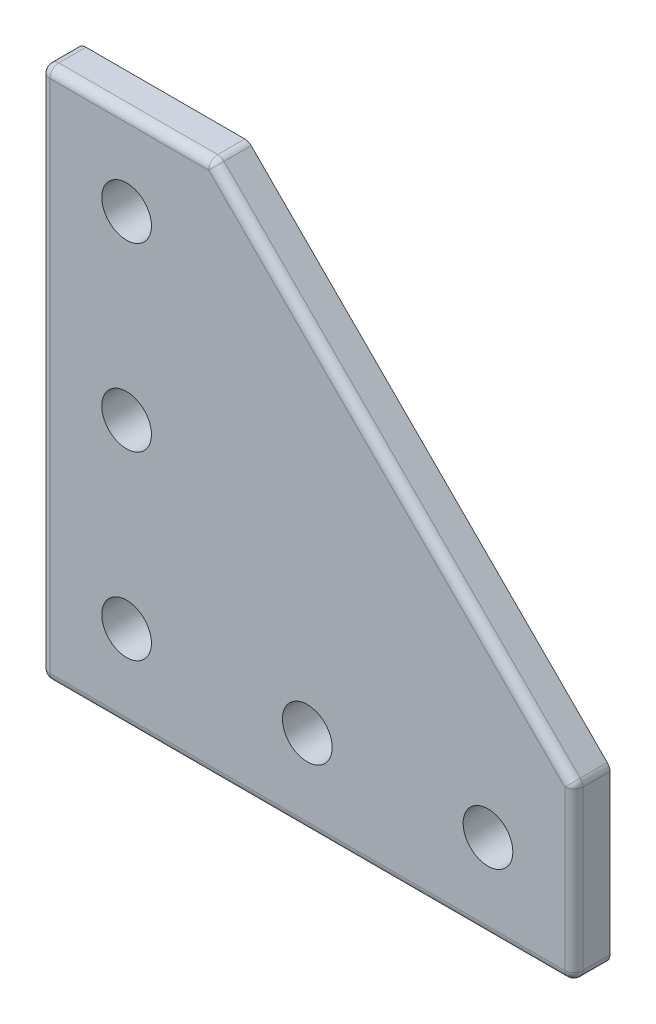
ISO-10303-21;
HEADER;
FILE_DESCRIPTION(('STEP AP214'),'2;1');
FILE_NAME('part.step','',(''),(''),'','','');
FILE_SCHEMA(('AUTOMOTIVE_DESIGN { 1 0 10303 214 1 1 1 1 }'));
ENDSEC;
DATA;
#1=APPLICATION_CONTEXT('core data for automotive mechanical design processes');
#2=APPLICATION_PROTOCOL_DEFINITION('international standard','automotive_design',2000,#1);
#3=PRODUCT_CONTEXT('',#1,'mechanical');
#4=PRODUCT('Part','Part','',(#3));
#5=PRODUCT_RELATED_PRODUCT_CATEGORY('part','',(#4));
#6=PRODUCT_DEFINITION_FORMATION('','',#4);
#7=PRODUCT_DEFINITION_CONTEXT('part definition',#1,'design');
#8=PRODUCT_DEFINITION('design','',#6,#7);
#9=PRODUCT_DEFINITION_SHAPE('','',#8);
#10=(LENGTH_UNIT() NAMED_UNIT(*) SI_UNIT(.MILLI.,.METRE.));
#11=(NAMED_UNIT(*) PLANE_ANGLE_UNIT() SI_UNIT($,.RADIAN.));
#12=(NAMED_UNIT(*) SI_UNIT($,.STERADIAN.) SOLID_ANGLE_UNIT());
#13=UNCERTAINTY_MEASURE_WITH_UNIT(LENGTH_MEASURE(1.E-05),#10,'distance_accuracy_value','');
#14=(GEOMETRIC_REPRESENTATION_CONTEXT(3) GLOBAL_UNCERTAINTY_ASSIGNED_CONTEXT((#13)) GLOBAL_UNIT_ASSIGNED_CONTEXT((#10,
#11,#12)) REPRESENTATION_CONTEXT('',''));
#15=CARTESIAN_POINT('',(0.,0.,0.));
#16=DIRECTION('',(0.,0.,1.));
#17=DIRECTION('',(1.,0.,0.));
#18=AXIS2_PLACEMENT_3D('',#15,#16,#17);
#19=CARTESIAN_POINT('',(0.,0.,2.));
#20=DIRECTION('',(0.,0.,-1.));
#21=DIRECTION('',(-1.,0.,0.));
#22=AXIS2_PLACEMENT_3D('',#19,#20,#21);
#23=PLANE('',#22);
#24=DIRECTION('',(0.,-1.,0.));
#25=VECTOR('',#24,1.);
#26=CARTESIAN_POINT('',(1.,0.,2.));
#27=LINE('',#26,#25);
#28=CARTESIAN_POINT('',(1.,58.,2.));
#29=VERTEX_POINT('',#28);
#30=CARTESIAN_POINT('',(1.,1.,2.));
#31=VERTEX_POINT('',#30);
#32=EDGE_CURVE('E1163',#29,#31,#27,.T.);
#33=ORIENTED_EDGE('',*,*,#32,.T.);
#34=DIRECTION('',(1.,0.,0.));
#35=VECTOR('',#34,1.);
#36=CARTESIAN_POINT('',(0.,1.,2.));
#37=LINE('',#36,#35);
#38=CARTESIAN_POINT('',(58.,0.999999999999998,2.));
#39=VERTEX_POINT('',#38);
#40=EDGE_CURVE('E1170',#31,#39,#37,.T.);
#41=ORIENTED_EDGE('',*,*,#40,.T.);
#42=DIRECTION('',(0.,1.,0.));
#43=VECTOR('',#42,1.);
#44=CARTESIAN_POINT('',(58.,0.,2.));
#45=LINE('',#44,#43);
#46=CARTESIAN_POINT('',(58.,18.5857864376269,2.));
#47=VERTEX_POINT('',#46);
#48=EDGE_CURVE('E1168',#39,#47,#45,.T.);
#49=ORIENTED_EDGE('',*,*,#48,.T.);
#50=DIRECTION('',(-0.707106781186547,0.707106781186548,0.));
#51=VECTOR('',#50,1.);
#52=CARTESIAN_POINT('',(38.2928932188135,38.2928932188134,2.));
#53=LINE('',#52,#51);
#54=CARTESIAN_POINT('',(18.5857864376269,58.,2.));
#55=VERTEX_POINT('',#54);
#56=EDGE_CURVE('E1165',#47,#55,#53,.T.);
#57=ORIENTED_EDGE('',*,*,#56,.T.);
#58=DIRECTION('',(-1.,0.,0.));
#59=VECTOR('',#58,1.);
#60=CARTESIAN_POINT('',(0.,58.,2.));
#61=LINE('',#60,#59);
#62=EDGE_CURVE('E1161',#55,#29,#61,.T.);
#63=ORIENTED_EDGE('',*,*,#62,.T.);
#64=EDGE_LOOP('',(#33,#41,#49,#57,#63));
#65=FACE_BOUND('',#64,.T.);
#66=CARTESIAN_POINT('',(9.5,29.5,2.));
#67=DIRECTION('',(0.,0.,1.));
#68=DIRECTION('',(1.,0.,0.));
#69=AXIS2_PLACEMENT_3D('',#66,#67,#68);
#70=CIRCLE('',#69,2.75000000000001);
#71=CARTESIAN_POINT('',(12.25,29.5,2.));
#72=VERTEX_POINT('',#71);
#73=EDGE_CURVE('E1240',#72,#72,#70,.T.);
#74=ORIENTED_EDGE('',*,*,#73,.F.);
#75=EDGE_LOOP('',(#74));
#76=FACE_BOUND('',#75,.T.);
#77=CARTESIAN_POINT('',(29.5,9.49999999999999,2.));
#78=DIRECTION('',(0.,0.,1.));
#79=DIRECTION('',(1.,0.,0.));
#80=AXIS2_PLACEMENT_3D('',#77,#78,#79);
#81=CIRCLE('',#80,2.75);
#82=CARTESIAN_POINT('',(32.25,9.49999999999999,2.));
#83=VERTEX_POINT('',#82);
#84=EDGE_CURVE('E1252',#83,#83,#81,.T.);
#85=ORIENTED_EDGE('',*,*,#84,.F.);
#86=EDGE_LOOP('',(#85));
#87=FACE_BOUND('',#86,.T.);
#88=CARTESIAN_POINT('',(9.5,9.49999999999999,2.));
#89=DIRECTION('',(0.,0.,1.));
#90=DIRECTION('',(1.,0.,0.));
#91=AXIS2_PLACEMENT_3D('',#88,#89,#90);
#92=CIRCLE('',#91,2.75);
#93=CARTESIAN_POINT('',(12.25,9.49999999999999,2.));
#94=VERTEX_POINT('',#93);
#95=EDGE_CURVE('E1258',#94,#94,#92,.T.);
#96=ORIENTED_EDGE('',*,*,#95,.F.);
#97=EDGE_LOOP('',(#96));
#98=FACE_BOUND('',#97,.T.);
#99=CARTESIAN_POINT('',(49.5,9.49999999999999,2.));
#100=DIRECTION('',(0.,0.,1.));
#101=DIRECTION('',(1.,0.,0.));
#102=AXIS2_PLACEMENT_3D('',#99,#100,#101);
#103=CIRCLE('',#102,2.75000000000001);
#104=CARTESIAN_POINT('',(52.25,9.49999999999999,2.));
#105=VERTEX_POINT('',#104);
#106=EDGE_CURVE('E1246',#105,#105,#103,.T.);
#107=ORIENTED_EDGE('',*,*,#106,.F.);
#108=EDGE_LOOP('',(#107));
#109=FACE_BOUND('',#108,.T.);
#110=CARTESIAN_POINT('',(9.5,49.5,2.));
#111=DIRECTION('',(0.,0.,1.));
#112=DIRECTION('',(1.,0.,0.));
#113=AXIS2_PLACEMENT_3D('',#110,#111,#112);
#114=CIRCLE('',#113,2.75);
#115=CARTESIAN_POINT('',(12.25,49.5,2.));
#116=VERTEX_POINT('',#115);
#117=EDGE_CURVE('E1232',#116,#116,#114,.T.);
#118=ORIENTED_EDGE('',*,*,#117,.F.);
#119=EDGE_LOOP('',(#118));
#120=FACE_BOUND('',#119,.T.);
#121=ADVANCED_FACE('F1020',(#65,#76,#87,#98,#109,#120),#23,.F.);
#122=CARTESIAN_POINT('',(0.,0.,-2.));
#123=DIRECTION('',(0.,0.,-1.));
#124=DIRECTION('',(-1.,0.,0.));
#125=AXIS2_PLACEMENT_3D('',#122,#123,#124);
#126=PLANE('',#125);
#127=CARTESIAN_POINT('',(9.5,29.5,-2.));
#128=DIRECTION('',(0.,0.,1.));
#129=DIRECTION('',(1.,0.,0.));
#130=AXIS2_PLACEMENT_3D('',#127,#128,#129);
#131=CIRCLE('',#130,2.75000000000001);
#132=CARTESIAN_POINT('',(12.25,29.5,-2.));
#133=VERTEX_POINT('',#132);
#134=EDGE_CURVE('E1237',#133,#133,#131,.T.);
#135=ORIENTED_EDGE('',*,*,#134,.T.);
#136=EDGE_LOOP('',(#135));
#137=FACE_BOUND('',#136,.T.);
#138=CARTESIAN_POINT('',(29.5,9.49999999999999,-2.));
#139=DIRECTION('',(0.,0.,1.));
#140=DIRECTION('',(1.,0.,0.));
#141=AXIS2_PLACEMENT_3D('',#138,#139,#140);
#142=CIRCLE('',#141,2.75);
#143=CARTESIAN_POINT('',(32.25,9.49999999999999,-2.));
#144=VERTEX_POINT('',#143);
#145=EDGE_CURVE('E1249',#144,#144,#142,.T.);
#146=ORIENTED_EDGE('',*,*,#145,.T.);
#147=EDGE_LOOP('',(#146));
#148=FACE_BOUND('',#147,.T.);
#149=DIRECTION('',(-0.707106781186547,0.707106781186548,0.));
#150=VECTOR('',#149,1.);
#151=CARTESIAN_POINT('',(19.,59.,-2.));
#152=LINE('',#151,#150);
#153=CARTESIAN_POINT('',(58.7071067811865,19.2928932188134,-2.));
#154=VERTEX_POINT('',#153);
#155=CARTESIAN_POINT('',(19.2928932188135,58.7071067811865,-2.));
#156=VERTEX_POINT('',#155);
#157=EDGE_CURVE('E1126',#154,#156,#152,.T.);
#158=ORIENTED_EDGE('',*,*,#157,.F.);
#159=CARTESIAN_POINT('',(58.,18.5857864376269,-2.));
#160=DIRECTION('',(0.,0.,-1.));
#161=DIRECTION('',(-1.,0.,0.));
#162=AXIS2_PLACEMENT_3D('',#159,#160,#161);
#163=CIRCLE('',#162,1.);
#164=CARTESIAN_POINT('',(59.,18.5857864376269,-2.));
#165=VERTEX_POINT('',#164);
#166=EDGE_CURVE('E1110',#154,#165,#163,.T.);
#167=ORIENTED_EDGE('',*,*,#166,.T.);
#168=DIRECTION('',(0.,1.,0.));
#169=VECTOR('',#168,1.);
#170=CARTESIAN_POINT('',(59.,19.,-2.));
#171=LINE('',#170,#169);
#172=CARTESIAN_POINT('',(59.,0.999999999999997,-2.));
#173=VERTEX_POINT('',#172);
#174=EDGE_CURVE('E1138',#173,#165,#171,.T.);
#175=ORIENTED_EDGE('',*,*,#174,.F.);
#176=CARTESIAN_POINT('',(58.,0.999999999999997,-2.));
#177=DIRECTION('',(0.,0.,-1.));
#178=DIRECTION('',(-1.,0.,0.));
#179=AXIS2_PLACEMENT_3D('',#176,#177,#178);
#180=CIRCLE('',#179,1.);
#181=CARTESIAN_POINT('',(58.,0.,-2.));
#182=VERTEX_POINT('',#181);
#183=EDGE_CURVE('E1152',#173,#182,#180,.T.);
#184=ORIENTED_EDGE('',*,*,#183,.T.);
#185=DIRECTION('',(1.,0.,0.));
#186=VECTOR('',#185,1.);
#187=CARTESIAN_POINT('',(59.,0.,-2.));
#188=LINE('',#187,#186);
#189=CARTESIAN_POINT('',(1.,0.,-2.));
#190=VERTEX_POINT('',#189);
#191=EDGE_CURVE('E1143',#190,#182,#188,.T.);
#192=ORIENTED_EDGE('',*,*,#191,.F.);
#193=CARTESIAN_POINT('',(1.,1.,-2.));
#194=DIRECTION('',(0.,0.,-1.));
#195=DIRECTION('',(-1.,0.,0.));
#196=AXIS2_PLACEMENT_3D('',#193,#194,#195);
#197=CIRCLE('',#196,1.);
#198=CARTESIAN_POINT('',(0.,1.,-2.));
#199=VERTEX_POINT('',#198);
#200=EDGE_CURVE('E1154',#190,#199,#197,.T.);
#201=ORIENTED_EDGE('',*,*,#200,.T.);
#202=DIRECTION('',(0.,-1.,0.));
#203=VECTOR('',#202,1.);
#204=CARTESIAN_POINT('',(0.,0.,-2.));
#205=LINE('',#204,#203);
#206=CARTESIAN_POINT('',(0.,58.,-2.));
#207=VERTEX_POINT('',#206);
#208=EDGE_CURVE('E1141',#207,#199,#205,.T.);
#209=ORIENTED_EDGE('',*,*,#208,.F.);
#210=CARTESIAN_POINT('',(1.,58.,-2.));
#211=DIRECTION('',(0.,0.,-1.));
#212=DIRECTION('',(-1.,0.,0.));
#213=AXIS2_PLACEMENT_3D('',#210,#211,#212);
#214=CIRCLE('',#213,1.);
#215=CARTESIAN_POINT('',(1.,59.,-2.));
#216=VERTEX_POINT('',#215);
#217=EDGE_CURVE('E1131',#207,#216,#214,.T.);
#218=ORIENTED_EDGE('',*,*,#217,.T.);
#219=DIRECTION('',(-1.,0.,0.));
#220=VECTOR('',#219,1.);
#221=CARTESIAN_POINT('',(19.,59.,-2.));
#222=LINE('',#221,#220);
#223=CARTESIAN_POINT('',(18.5857864376269,59.,-2.));
#224=VERTEX_POINT('',#223);
#225=EDGE_CURVE('E1137',#224,#216,#222,.T.);
#226=ORIENTED_EDGE('',*,*,#225,.F.);
#227=CARTESIAN_POINT('',(18.5857864376269,58.,-2.));
#228=DIRECTION('',(0.,0.,-1.));
#229=DIRECTION('',(-1.,0.,0.));
#230=AXIS2_PLACEMENT_3D('',#227,#228,#229);
#231=CIRCLE('',#230,1.);
#232=EDGE_CURVE('E1121',#224,#156,#231,.T.);
#233=ORIENTED_EDGE('',*,*,#232,.T.);
#234=EDGE_LOOP('',(#158,#167,#175,#184,#192,#201,#209,#218,#226,#233));
#235=FACE_BOUND('',#234,.T.);
#236=CARTESIAN_POINT('',(9.5,9.49999999999999,-2.));
#237=DIRECTION('',(0.,0.,1.));
#238=DIRECTION('',(1.,0.,0.));
#239=AXIS2_PLACEMENT_3D('',#236,#237,#238);
#240=CIRCLE('',#239,2.75);
#241=CARTESIAN_POINT('',(12.25,9.49999999999999,-2.));
#242=VERTEX_POINT('',#241);
#243=EDGE_CURVE('E1255',#242,#242,#240,.T.);
#244=ORIENTED_EDGE('',*,*,#243,.T.);
#245=EDGE_LOOP('',(#244));
#246=FACE_BOUND('',#245,.T.);
#247=CARTESIAN_POINT('',(49.5,9.49999999999999,-2.));
#248=DIRECTION('',(0.,0.,1.));
#249=DIRECTION('',(1.,0.,0.));
#250=AXIS2_PLACEMENT_3D('',#247,#248,#249);
#251=CIRCLE('',#250,2.75000000000001);
#252=CARTESIAN_POINT('',(52.25,9.49999999999999,-2.));
#253=VERTEX_POINT('',#252);
#254=EDGE_CURVE('E1243',#253,#253,#251,.T.);
#255=ORIENTED_EDGE('',*,*,#254,.T.);
#256=EDGE_LOOP('',(#255));
#257=FACE_BOUND('',#256,.T.);
#258=CARTESIAN_POINT('',(9.5,49.5,-2.));
#259=DIRECTION('',(0.,0.,1.));
#260=DIRECTION('',(1.,0.,0.));
#261=AXIS2_PLACEMENT_3D('',#258,#259,#260);
#262=CIRCLE('',#261,2.75);
#263=CARTESIAN_POINT('',(12.25,49.5,-2.));
#264=VERTEX_POINT('',#263);
#265=EDGE_CURVE('E1229',#264,#264,#262,.T.);
#266=ORIENTED_EDGE('',*,*,#265,.T.);
#267=EDGE_LOOP('',(#266));
#268=FACE_BOUND('',#267,.T.);
#269=ADVANCED_FACE('F1133',(#137,#148,#235,#246,#257,#268),#126,.T.);
#270=CARTESIAN_POINT('',(59.,0.,2.));
#271=DIRECTION('',(0.,1.,0.));
#272=DIRECTION('',(-1.,0.,0.));
#273=AXIS2_PLACEMENT_3D('',#270,#271,#272);
#274=PLANE('',#273);
#275=DIRECTION('',(1.,0.,0.));
#276=VECTOR('',#275,1.);
#277=CARTESIAN_POINT('',(59.,0.,1.));
#278=LINE('',#277,#276);
#279=CARTESIAN_POINT('',(58.,0.,1.));
#280=VERTEX_POINT('',#279);
#281=CARTESIAN_POINT('',(1.,0.,1.));
#282=VERTEX_POINT('',#281);
#283=EDGE_CURVE('E1180',#280,#282,#278,.F.);
#284=ORIENTED_EDGE('',*,*,#283,.T.);
#285=DIRECTION('',(0.,0.,-1.));
#286=VECTOR('',#285,1.);
#287=CARTESIAN_POINT('',(1.,0.,2.));
#288=LINE('',#287,#286);
#289=EDGE_CURVE('E1182',#282,#190,#288,.T.);
#290=ORIENTED_EDGE('',*,*,#289,.T.);
#291=ORIENTED_EDGE('',*,*,#191,.T.);
#292=DIRECTION('',(0.,0.,-1.));
#293=VECTOR('',#292,1.);
#294=CARTESIAN_POINT('',(58.,0.,2.));
#295=LINE('',#294,#293);
#296=EDGE_CURVE('E1178',#182,#280,#295,.F.);
#297=ORIENTED_EDGE('',*,*,#296,.T.);
#298=EDGE_LOOP('',(#284,#290,#291,#297));
#299=FACE_BOUND('',#298,.T.);
#300=ADVANCED_FACE('F1266',(#299),#274,.F.);
#301=CARTESIAN_POINT('',(59.,19.,2.));
#302=DIRECTION('',(-1.,0.,0.));
#303=DIRECTION('',(0.,0.,1.));
#304=AXIS2_PLACEMENT_3D('',#301,#302,#303);
#305=PLANE('',#304);
#306=ORIENTED_EDGE('',*,*,#174,.T.);
#307=DIRECTION('',(0.,0.,-1.));
#308=VECTOR('',#307,1.);
#309=CARTESIAN_POINT('',(59.,18.5857864376269,2.));
#310=LINE('',#309,#308);
#311=CARTESIAN_POINT('',(59.,18.5857864376269,1.));
#312=VERTEX_POINT('',#311);
#313=EDGE_CURVE('E1115',#165,#312,#310,.F.);
#314=ORIENTED_EDGE('',*,*,#313,.T.);
#315=DIRECTION('',(0.,1.,0.));
#316=VECTOR('',#315,1.);
#317=CARTESIAN_POINT('',(59.,19.,1.));
#318=LINE('',#317,#316);
#319=CARTESIAN_POINT('',(59.,0.999999999999997,1.));
#320=VERTEX_POINT('',#319);
#321=EDGE_CURVE('E1158',#312,#320,#318,.F.);
#322=ORIENTED_EDGE('',*,*,#321,.T.);
#323=DIRECTION('',(0.,0.,-1.));
#324=VECTOR('',#323,1.);
#325=CARTESIAN_POINT('',(59.,0.999999999999997,2.));
#326=LINE('',#325,#324);
#327=EDGE_CURVE('E1120',#320,#173,#326,.T.);
#328=ORIENTED_EDGE('',*,*,#327,.T.);
#329=EDGE_LOOP('',(#306,#314,#322,#328));
#330=FACE_BOUND('',#329,.T.);
#331=ADVANCED_FACE('F1323',(#330),#305,.F.);
#332=CARTESIAN_POINT('',(19.,59.,2.));
#333=DIRECTION('',(-0.707106781186548,-0.707106781186547,0.));
#334=DIRECTION('',(0.707106781186547,-0.707106781186548,0.));
#335=AXIS2_PLACEMENT_3D('',#332,#333,#334);
#336=PLANE('',#335);
#337=DIRECTION('',(-0.707106781186547,0.707106781186548,0.));
#338=VECTOR('',#337,1.);
#339=CARTESIAN_POINT('',(19.,59.,1.));
#340=LINE('',#339,#338);
#341=CARTESIAN_POINT('',(19.2928932188135,58.7071067811865,1.));
#342=VERTEX_POINT('',#341);
#343=CARTESIAN_POINT('',(58.7071067811865,19.2928932188134,1.));
#344=VERTEX_POINT('',#343);
#345=EDGE_CURVE('E1129',#342,#344,#340,.F.);
#346=ORIENTED_EDGE('',*,*,#345,.T.);
#347=DIRECTION('',(0.,0.,-1.));
#348=VECTOR('',#347,1.);
#349=CARTESIAN_POINT('',(58.7071067811865,19.2928932188134,2.));
#350=LINE('',#349,#348);
#351=EDGE_CURVE('E1114',#344,#154,#350,.T.);
#352=ORIENTED_EDGE('',*,*,#351,.T.);
#353=ORIENTED_EDGE('',*,*,#157,.T.);
#354=DIRECTION('',(0.,0.,-1.));
#355=VECTOR('',#354,1.);
#356=CARTESIAN_POINT('',(19.2928932188135,58.7071067811865,2.));
#357=LINE('',#356,#355);
#358=EDGE_CURVE('E1148',#156,#342,#357,.F.);
#359=ORIENTED_EDGE('',*,*,#358,.T.);
#360=EDGE_LOOP('',(#346,#352,#353,#359));
#361=FACE_BOUND('',#360,.T.);
#362=ADVANCED_FACE('F1125',(#361),#336,.F.);
#363=CARTESIAN_POINT('',(19.,59.,2.));
#364=DIRECTION('',(0.,-1.,0.));
#365=DIRECTION('',(0.,0.,-1.));
#366=AXIS2_PLACEMENT_3D('',#363,#364,#365);
#367=PLANE('',#366);
#368=DIRECTION('',(-1.,0.,0.));
#369=VECTOR('',#368,1.);
#370=CARTESIAN_POINT('',(19.,59.,1.));
#371=LINE('',#370,#369);
#372=CARTESIAN_POINT('',(1.,59.,1.));
#373=VERTEX_POINT('',#372);
#374=CARTESIAN_POINT('',(18.5857864376269,59.,1.));
#375=VERTEX_POINT('',#374);
#376=EDGE_CURVE('E1174',#373,#375,#371,.F.);
#377=ORIENTED_EDGE('',*,*,#376,.T.);
#378=DIRECTION('',(0.,0.,-1.));
#379=VECTOR('',#378,1.);
#380=CARTESIAN_POINT('',(18.5857864376269,59.,2.));
#381=LINE('',#380,#379);
#382=EDGE_CURVE('E1176',#375,#224,#381,.T.);
#383=ORIENTED_EDGE('',*,*,#382,.T.);
#384=ORIENTED_EDGE('',*,*,#225,.T.);
#385=DIRECTION('',(0.,0.,-1.));
#386=VECTOR('',#385,1.);
#387=CARTESIAN_POINT('',(1.,59.,2.));
#388=LINE('',#387,#386);
#389=EDGE_CURVE('E1172',#216,#373,#388,.F.);
#390=ORIENTED_EDGE('',*,*,#389,.T.);
#391=EDGE_LOOP('',(#377,#383,#384,#390));
#392=FACE_BOUND('',#391,.T.);
#393=ADVANCED_FACE('F1305',(#392),#367,.F.);
#394=CARTESIAN_POINT('',(0.,0.,2.));
#395=DIRECTION('',(1.,0.,0.));
#396=DIRECTION('',(0.,0.,-1.));
#397=AXIS2_PLACEMENT_3D('',#394,#395,#396);
#398=PLANE('',#397);
#399=ORIENTED_EDGE('',*,*,#208,.T.);
#400=DIRECTION('',(0.,0.,-1.));
#401=VECTOR('',#400,1.);
#402=CARTESIAN_POINT('',(0.,1.,2.));
#403=LINE('',#402,#401);
#404=CARTESIAN_POINT('',(0.,1.,1.));
#405=VERTEX_POINT('',#404);
#406=EDGE_CURVE('E12',#199,#405,#403,.F.);
#407=ORIENTED_EDGE('',*,*,#406,.T.);
#408=DIRECTION('',(0.,-1.,0.));
#409=VECTOR('',#408,1.);
#410=CARTESIAN_POINT('',(0.,0.,1.));
#411=LINE('',#410,#409);
#412=CARTESIAN_POINT('',(0.,58.,1.));
#413=VERTEX_POINT('',#412);
#414=EDGE_CURVE('E1029',#405,#413,#411,.F.);
#415=ORIENTED_EDGE('',*,*,#414,.T.);
#416=DIRECTION('',(0.,0.,-1.));
#417=VECTOR('',#416,1.);
#418=CARTESIAN_POINT('',(0.,58.,2.));
#419=LINE('',#418,#417);
#420=EDGE_CURVE('E1184',#413,#207,#419,.T.);
#421=ORIENTED_EDGE('',*,*,#420,.T.);
#422=EDGE_LOOP('',(#399,#407,#415,#421));
#423=FACE_BOUND('',#422,.T.);
#424=ADVANCED_FACE('F1286',(#423),#398,.F.);
#425=CARTESIAN_POINT('',(9.5,9.49999999999999,2.));
#426=DIRECTION('',(0.,0.,-1.));
#427=DIRECTION('',(-1.,0.,0.));
#428=AXIS2_PLACEMENT_3D('',#425,#426,#427);
#429=CYLINDRICAL_SURFACE('',#428,2.75);
#430=ORIENTED_EDGE('',*,*,#95,.T.);
#431=EDGE_LOOP('',(#430));
#432=FACE_BOUND('',#431,.T.);
#433=ORIENTED_EDGE('',*,*,#243,.F.);
#434=EDGE_LOOP('',(#433));
#435=FACE_BOUND('',#434,.T.);
#436=ADVANCED_FACE('F1342',(#432,#435),#429,.F.);
#437=CARTESIAN_POINT('',(29.5,9.49999999999999,2.));
#438=DIRECTION('',(0.,0.,-1.));
#439=DIRECTION('',(-1.,0.,0.));
#440=AXIS2_PLACEMENT_3D('',#437,#438,#439);
#441=CYLINDRICAL_SURFACE('',#440,2.75);
#442=ORIENTED_EDGE('',*,*,#84,.T.);
#443=EDGE_LOOP('',(#442));
#444=FACE_BOUND('',#443,.T.);
#445=ORIENTED_EDGE('',*,*,#145,.F.);
#446=EDGE_LOOP('',(#445));
#447=FACE_BOUND('',#446,.T.);
#448=ADVANCED_FACE('F1360',(#444,#447),#441,.F.);
#449=CARTESIAN_POINT('',(49.5,9.49999999999999,2.));
#450=DIRECTION('',(0.,0.,-1.));
#451=DIRECTION('',(-1.,0.,0.));
#452=AXIS2_PLACEMENT_3D('',#449,#450,#451);
#453=CYLINDRICAL_SURFACE('',#452,2.75000000000001);
#454=ORIENTED_EDGE('',*,*,#106,.T.);
#455=EDGE_LOOP('',(#454));
#456=FACE_BOUND('',#455,.T.);
#457=ORIENTED_EDGE('',*,*,#254,.F.);
#458=EDGE_LOOP('',(#457));
#459=FACE_BOUND('',#458,.T.);
#460=ADVANCED_FACE('F1366',(#456,#459),#453,.F.);
#461=CARTESIAN_POINT('',(9.5,29.5,2.));
#462=DIRECTION('',(0.,0.,-1.));
#463=DIRECTION('',(-1.,0.,0.));
#464=AXIS2_PLACEMENT_3D('',#461,#462,#463);
#465=CYLINDRICAL_SURFACE('',#464,2.75000000000001);
#466=ORIENTED_EDGE('',*,*,#73,.T.);
#467=EDGE_LOOP('',(#466));
#468=FACE_BOUND('',#467,.T.);
#469=ORIENTED_EDGE('',*,*,#134,.F.);
#470=EDGE_LOOP('',(#469));
#471=FACE_BOUND('',#470,.T.);
#472=ADVANCED_FACE('F1372',(#468,#471),#465,.F.);
#473=CARTESIAN_POINT('',(9.5,49.5,2.));
#474=DIRECTION('',(0.,0.,-1.));
#475=DIRECTION('',(-1.,0.,0.));
#476=AXIS2_PLACEMENT_3D('',#473,#474,#475);
#477=CYLINDRICAL_SURFACE('',#476,2.75);
#478=ORIENTED_EDGE('',*,*,#117,.T.);
#479=EDGE_LOOP('',(#478));
#480=FACE_BOUND('',#479,.T.);
#481=ORIENTED_EDGE('',*,*,#265,.F.);
#482=EDGE_LOOP('',(#481));
#483=FACE_BOUND('',#482,.T.);
#484=ADVANCED_FACE('F1379',(#480,#483),#477,.F.);
#485=CARTESIAN_POINT('',(1.,1.,2.));
#486=DIRECTION('',(0.,0.,-1.));
#487=DIRECTION('',(-1.,0.,0.));
#488=AXIS2_PLACEMENT_3D('',#485,#486,#487);
#489=CYLINDRICAL_SURFACE('',#488,1.);
#490=ORIENTED_EDGE('',*,*,#200,.F.);
#491=ORIENTED_EDGE('',*,*,#289,.F.);
#492=CARTESIAN_POINT('',(1.,1.,1.));
#493=DIRECTION('',(0.,0.,1.));
#494=DIRECTION('',(1.,0.,0.));
#495=AXIS2_PLACEMENT_3D('',#492,#493,#494);
#496=CIRCLE('',#495,1.);
#497=EDGE_CURVE('E1024',#405,#282,#496,.T.);
#498=ORIENTED_EDGE('',*,*,#497,.F.);
#499=ORIENTED_EDGE('',*,*,#406,.F.);
#500=EDGE_LOOP('',(#490,#491,#498,#499));
#501=FACE_BOUND('',#500,.T.);
#502=ADVANCED_FACE('F1022',(#501),#489,.T.);
#503=CARTESIAN_POINT('',(1.,0.,1.));
#504=DIRECTION('',(0.,-1.,0.));
#505=DIRECTION('',(0.,0.,-1.));
#506=AXIS2_PLACEMENT_3D('',#503,#504,#505);
#507=CYLINDRICAL_SURFACE('',#506,1.);
#508=CARTESIAN_POINT('',(1.,58.,1.));
#509=DIRECTION('',(0.,1.,0.));
#510=DIRECTION('',(0.,0.,1.));
#511=AXIS2_PLACEMENT_3D('',#508,#509,#510);
#512=CIRCLE('',#511,1.);
#513=EDGE_CURVE('E1221',#413,#29,#512,.T.);
#514=ORIENTED_EDGE('',*,*,#513,.F.);
#515=ORIENTED_EDGE('',*,*,#414,.F.);
#516=CARTESIAN_POINT('',(1.,1.,1.));
#517=DIRECTION('',(0.,-1.,0.));
#518=DIRECTION('',(0.,0.,-1.));
#519=AXIS2_PLACEMENT_3D('',#516,#517,#518);
#520=CIRCLE('',#519,1.);
#521=EDGE_CURVE('E1223',#31,#405,#520,.T.);
#522=ORIENTED_EDGE('',*,*,#521,.F.);
#523=ORIENTED_EDGE('',*,*,#32,.F.);
#524=EDGE_LOOP('',(#514,#515,#522,#523));
#525=FACE_BOUND('',#524,.T.);
#526=ADVANCED_FACE('F1295',(#525),#507,.T.);
#527=CARTESIAN_POINT('',(1.,58.,2.));
#528=DIRECTION('',(0.,0.,-1.));
#529=DIRECTION('',(-1.,0.,0.));
#530=AXIS2_PLACEMENT_3D('',#527,#528,#529);
#531=CYLINDRICAL_SURFACE('',#530,1.);
#532=ORIENTED_EDGE('',*,*,#217,.F.);
#533=ORIENTED_EDGE('',*,*,#420,.F.);
#534=CARTESIAN_POINT('',(1.,58.,1.));
#535=DIRECTION('',(0.,0.,1.));
#536=DIRECTION('',(1.,0.,0.));
#537=AXIS2_PLACEMENT_3D('',#534,#535,#536);
#538=CIRCLE('',#537,1.);
#539=EDGE_CURVE('E1218',#373,#413,#538,.T.);
#540=ORIENTED_EDGE('',*,*,#539,.F.);
#541=ORIENTED_EDGE('',*,*,#389,.F.);
#542=EDGE_LOOP('',(#532,#533,#540,#541));
#543=FACE_BOUND('',#542,.T.);
#544=ADVANCED_FACE('F1290',(#543),#531,.T.);
#545=CARTESIAN_POINT('',(1.,1.,1.));
#546=DIRECTION('',(0.,0.,1.));
#547=DIRECTION('',(1.,0.,0.));
#548=AXIS2_PLACEMENT_3D('',#545,#546,#547);
#549=SPHERICAL_SURFACE('',#548,1.);
#550=ORIENTED_EDGE('',*,*,#521,.T.);
#551=ORIENTED_EDGE('',*,*,#497,.T.);
#552=CARTESIAN_POINT('',(1.,1.,1.));
#553=DIRECTION('',(-1.,0.,0.));
#554=DIRECTION('',(0.,0.,1.));
#555=AXIS2_PLACEMENT_3D('',#552,#553,#554);
#556=CIRCLE('',#555,1.);
#557=EDGE_CURVE('E1215',#31,#282,#556,.F.);
#558=ORIENTED_EDGE('',*,*,#557,.F.);
#559=EDGE_LOOP('',(#550,#551,#558));
#560=FACE_BOUND('',#559,.T.);
#561=ADVANCED_FACE('F1402',(#560),#549,.T.);
#562=CARTESIAN_POINT('',(1.,58.,1.));
#563=DIRECTION('',(0.,0.,1.));
#564=DIRECTION('',(1.,0.,0.));
#565=AXIS2_PLACEMENT_3D('',#562,#563,#564);
#566=SPHERICAL_SURFACE('',#565,1.);
#567=ORIENTED_EDGE('',*,*,#539,.T.);
#568=ORIENTED_EDGE('',*,*,#513,.T.);
#569=CARTESIAN_POINT('',(1.,58.,1.));
#570=DIRECTION('',(-1.,0.,0.));
#571=DIRECTION('',(0.,0.,1.));
#572=AXIS2_PLACEMENT_3D('',#569,#570,#571);
#573=CIRCLE('',#572,1.);
#574=EDGE_CURVE('E1212',#373,#29,#573,.F.);
#575=ORIENTED_EDGE('',*,*,#574,.F.);
#576=EDGE_LOOP('',(#567,#568,#575));
#577=FACE_BOUND('',#576,.T.);
#578=ADVANCED_FACE('F1297',(#577),#566,.T.);
#579=CARTESIAN_POINT('',(58.,0.999999999999997,2.));
#580=DIRECTION('',(0.,0.,-1.));
#581=DIRECTION('',(-1.,0.,0.));
#582=AXIS2_PLACEMENT_3D('',#579,#580,#581);
#583=CYLINDRICAL_SURFACE('',#582,1.);
#584=ORIENTED_EDGE('',*,*,#183,.F.);
#585=ORIENTED_EDGE('',*,*,#327,.F.);
#586=CARTESIAN_POINT('',(58.,0.999999999999998,1.));
#587=DIRECTION('',(0.,0.,1.));
#588=DIRECTION('',(1.,0.,0.));
#589=AXIS2_PLACEMENT_3D('',#586,#587,#588);
#590=CIRCLE('',#589,1.);
#591=EDGE_CURVE('E1209',#280,#320,#590,.T.);
#592=ORIENTED_EDGE('',*,*,#591,.F.);
#593=ORIENTED_EDGE('',*,*,#296,.F.);
#594=EDGE_LOOP('',(#584,#585,#592,#593));
#595=FACE_BOUND('',#594,.T.);
#596=ADVANCED_FACE('F1273',(#595),#583,.T.);
#597=CARTESIAN_POINT('',(0.,1.,1.));
#598=DIRECTION('',(1.,0.,0.));
#599=DIRECTION('',(0.,1.,0.));
#600=AXIS2_PLACEMENT_3D('',#597,#598,#599);
#601=CYLINDRICAL_SURFACE('',#600,1.);
#602=ORIENTED_EDGE('',*,*,#557,.T.);
#603=ORIENTED_EDGE('',*,*,#283,.F.);
#604=CARTESIAN_POINT('',(58.,0.999999999999998,1.));
#605=DIRECTION('',(1.,0.,0.));
#606=DIRECTION('',(0.,0.,-1.));
#607=AXIS2_PLACEMENT_3D('',#604,#605,#606);
#608=CIRCLE('',#607,1.);
#609=EDGE_CURVE('E1206',#39,#280,#608,.T.);
#610=ORIENTED_EDGE('',*,*,#609,.F.);
#611=ORIENTED_EDGE('',*,*,#40,.F.);
#612=EDGE_LOOP('',(#602,#603,#610,#611));
#613=FACE_BOUND('',#612,.T.);
#614=ADVANCED_FACE('F1282',(#613),#601,.T.);
#615=CARTESIAN_POINT('',(0.,58.,1.));
#616=DIRECTION('',(-1.,0.,0.));
#617=DIRECTION('',(0.,0.,1.));
#618=AXIS2_PLACEMENT_3D('',#615,#616,#617);
#619=CYLINDRICAL_SURFACE('',#618,1.);
#620=ORIENTED_EDGE('',*,*,#574,.T.);
#621=ORIENTED_EDGE('',*,*,#62,.F.);
#622=CARTESIAN_POINT('',(18.5857864376269,58.,1.));
#623=DIRECTION('',(1.,0.,0.));
#624=DIRECTION('',(0.,0.,-1.));
#625=AXIS2_PLACEMENT_3D('',#622,#623,#624);
#626=CIRCLE('',#625,1.);
#627=EDGE_CURVE('E1203',#375,#55,#626,.T.);
#628=ORIENTED_EDGE('',*,*,#627,.F.);
#629=ORIENTED_EDGE('',*,*,#376,.F.);
#630=EDGE_LOOP('',(#620,#621,#628,#629));
#631=FACE_BOUND('',#630,.T.);
#632=ADVANCED_FACE('F1302',(#631),#619,.T.);
#633=CARTESIAN_POINT('',(18.5857864376269,58.,2.));
#634=DIRECTION('',(0.,0.,-1.));
#635=DIRECTION('',(-1.,0.,0.));
#636=AXIS2_PLACEMENT_3D('',#633,#634,#635);
#637=CYLINDRICAL_SURFACE('',#636,1.);
#638=ORIENTED_EDGE('',*,*,#232,.F.);
#639=ORIENTED_EDGE('',*,*,#382,.F.);
#640=CARTESIAN_POINT('',(18.5857864376269,58.,1.));
#641=DIRECTION('',(0.,0.,1.));
#642=DIRECTION('',(1.,0.,0.));
#643=AXIS2_PLACEMENT_3D('',#640,#641,#642);
#644=CIRCLE('',#643,1.);
#645=EDGE_CURVE('E1200',#342,#375,#644,.T.);
#646=ORIENTED_EDGE('',*,*,#645,.F.);
#647=ORIENTED_EDGE('',*,*,#358,.F.);
#648=EDGE_LOOP('',(#638,#639,#646,#647));
#649=FACE_BOUND('',#648,.T.);
#650=ADVANCED_FACE('F1308',(#649),#637,.T.);
#651=CARTESIAN_POINT('',(58.,0.999999999999998,1.));
#652=DIRECTION('',(0.,0.,1.));
#653=DIRECTION('',(1.,0.,0.));
#654=AXIS2_PLACEMENT_3D('',#651,#652,#653);
#655=SPHERICAL_SURFACE('',#654,1.);
#656=ORIENTED_EDGE('',*,*,#609,.T.);
#657=ORIENTED_EDGE('',*,*,#591,.T.);
#658=CARTESIAN_POINT('',(58.,0.999999999999997,1.));
#659=DIRECTION('',(0.,-1.,0.));
#660=DIRECTION('',(0.,0.,-1.));
#661=AXIS2_PLACEMENT_3D('',#658,#659,#660);
#662=CIRCLE('',#661,1.);
#663=EDGE_CURVE('E1197',#39,#320,#662,.F.);
#664=ORIENTED_EDGE('',*,*,#663,.F.);
#665=EDGE_LOOP('',(#656,#657,#664));
#666=FACE_BOUND('',#665,.T.);
#667=ADVANCED_FACE('F1278',(#666),#655,.T.);
#668=CARTESIAN_POINT('',(18.5857864376269,58.,1.));
#669=DIRECTION('',(0.,0.,1.));
#670=DIRECTION('',(1.,0.,0.));
#671=AXIS2_PLACEMENT_3D('',#668,#669,#670);
#672=SPHERICAL_SURFACE('',#671,1.);
#673=ORIENTED_EDGE('',*,*,#645,.T.);
#674=ORIENTED_EDGE('',*,*,#627,.T.);
#675=CARTESIAN_POINT('',(18.5857864376269,58.,1.));
#676=DIRECTION('',(-0.707106781186553,0.707106781186542,0.));
#677=DIRECTION('',(-0.707106781186542,-0.707106781186553,0.));
#678=AXIS2_PLACEMENT_3D('',#675,#676,#677);
#679=CIRCLE('',#678,1.);
#680=EDGE_CURVE('E1195',#342,#55,#679,.F.);
#681=ORIENTED_EDGE('',*,*,#680,.F.);
#682=EDGE_LOOP('',(#673,#674,#681));
#683=FACE_BOUND('',#682,.T.);
#684=ADVANCED_FACE('F1311',(#683),#672,.T.);
#685=CARTESIAN_POINT('',(58.,0.,1.));
#686=DIRECTION('',(0.,1.,0.));
#687=DIRECTION('',(0.,0.,1.));
#688=AXIS2_PLACEMENT_3D('',#685,#686,#687);
#689=CYLINDRICAL_SURFACE('',#688,1.);
#690=ORIENTED_EDGE('',*,*,#663,.T.);
#691=ORIENTED_EDGE('',*,*,#321,.F.);
#692=CARTESIAN_POINT('',(58.,18.5857864376269,1.));
#693=DIRECTION('',(0.,1.,0.));
#694=DIRECTION('',(-1.,0.,0.));
#695=AXIS2_PLACEMENT_3D('',#692,#693,#694);
#696=CIRCLE('',#695,1.);
#697=EDGE_CURVE('E1192',#47,#312,#696,.T.);
#698=ORIENTED_EDGE('',*,*,#697,.F.);
#699=ORIENTED_EDGE('',*,*,#48,.F.);
#700=EDGE_LOOP('',(#690,#691,#698,#699));
#701=FACE_BOUND('',#700,.T.);
#702=ADVANCED_FACE('F1321',(#701),#689,.T.);
#703=CARTESIAN_POINT('',(38.2928932188135,38.2928932188134,1.));
#704=DIRECTION('',(-0.707106781186547,0.707106781186548,0.));
#705=DIRECTION('',(-0.707106781186548,-0.707106781186547,0.));
#706=AXIS2_PLACEMENT_3D('',#703,#704,#705);
#707=CYLINDRICAL_SURFACE('',#706,1.);
#708=ORIENTED_EDGE('',*,*,#680,.T.);
#709=ORIENTED_EDGE('',*,*,#56,.F.);
#710=CARTESIAN_POINT('',(58.,18.5857864376269,1.));
#711=DIRECTION('',(0.707106781186549,-0.707106781186546,0.));
#712=DIRECTION('',(0.707106781186546,0.707106781186549,0.));
#713=AXIS2_PLACEMENT_3D('',#710,#711,#712);
#714=CIRCLE('',#713,1.);
#715=EDGE_CURVE('E1189',#344,#47,#714,.T.);
#716=ORIENTED_EDGE('',*,*,#715,.F.);
#717=ORIENTED_EDGE('',*,*,#345,.F.);
#718=EDGE_LOOP('',(#708,#709,#716,#717));
#719=FACE_BOUND('',#718,.T.);
#720=ADVANCED_FACE('F1314',(#719),#707,.T.);
#721=CARTESIAN_POINT('',(58.,18.5857864376269,1.));
#722=DIRECTION('',(0.,0.,1.));
#723=DIRECTION('',(1.,0.,0.));
#724=AXIS2_PLACEMENT_3D('',#721,#722,#723);
#725=SPHERICAL_SURFACE('',#724,1.);
#726=ORIENTED_EDGE('',*,*,#715,.T.);
#727=ORIENTED_EDGE('',*,*,#697,.T.);
#728=CARTESIAN_POINT('',(58.,18.5857864376269,1.));
#729=DIRECTION('',(0.,0.,1.));
#730=DIRECTION('',(1.,0.,0.));
#731=AXIS2_PLACEMENT_3D('',#728,#729,#730);
#732=CIRCLE('',#731,1.);
#733=EDGE_CURVE('E1187',#344,#312,#732,.F.);
#734=ORIENTED_EDGE('',*,*,#733,.F.);
#735=EDGE_LOOP('',(#726,#727,#734));
#736=FACE_BOUND('',#735,.T.);
#737=ADVANCED_FACE('F1318',(#736),#725,.T.);
#738=CARTESIAN_POINT('',(58.,18.5857864376269,2.));
#739=DIRECTION('',(0.,0.,-1.));
#740=DIRECTION('',(-1.,0.,0.));
#741=AXIS2_PLACEMENT_3D('',#738,#739,#740);
#742=CYLINDRICAL_SURFACE('',#741,1.);
#743=ORIENTED_EDGE('',*,*,#733,.T.);
#744=ORIENTED_EDGE('',*,*,#313,.F.);
#745=ORIENTED_EDGE('',*,*,#166,.F.);
#746=ORIENTED_EDGE('',*,*,#351,.F.);
#747=EDGE_LOOP('',(#743,#744,#745,#746));
#748=FACE_BOUND('',#747,.T.);
#749=ADVANCED_FACE('F1113',(#748),#742,.T.);
#750=CLOSED_SHELL('',(#121,#269,#300,#331,#362,#393,#424,#436,#448,#460,#472,#484,#502,#526,
#544,#561,#578,#596,#614,#632,#650,#667,#684,#702,#720,#737,#749));
#751=MANIFOLD_SOLID_BREP('B2',#750);
#752=ADVANCED_BREP_SHAPE_REPRESENTATION('',(#18,#751),#14);
#753=SHAPE_DEFINITION_REPRESENTATION(#9,#752);
ENDSEC;
END-ISO-10303-21;
